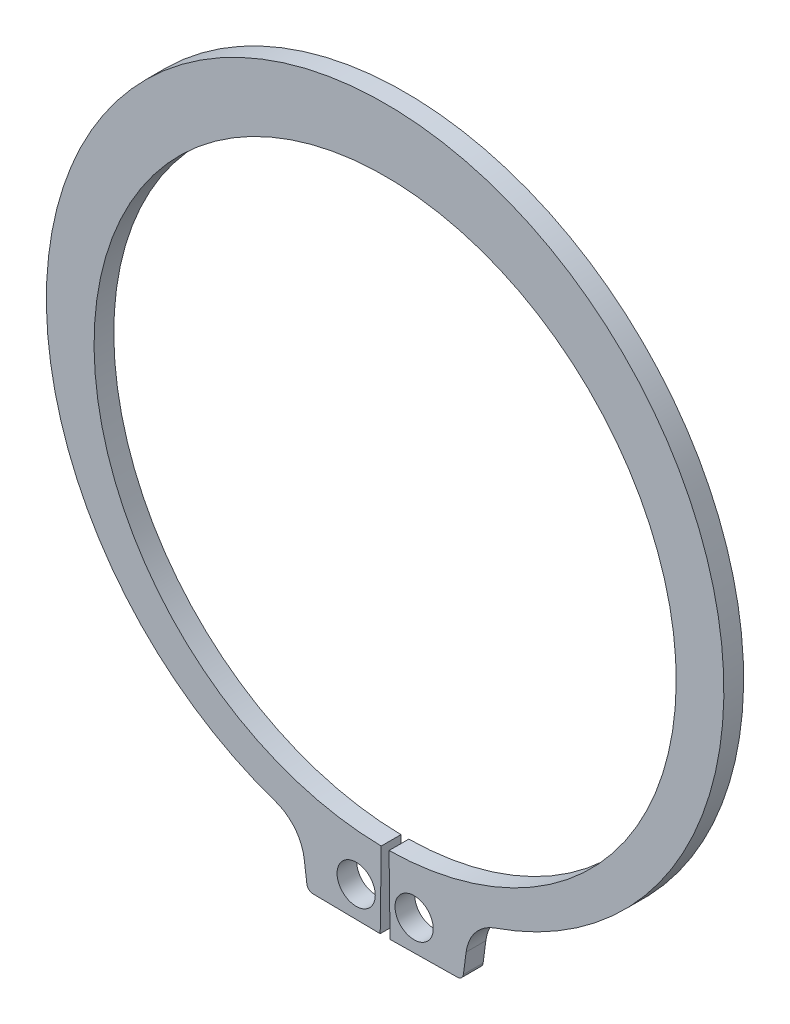
ISO-10303-21;
HEADER;
FILE_DESCRIPTION(('STEP AP214'),'2;1');
FILE_NAME('part.step','',(''),(''),'','','');
FILE_SCHEMA(('AUTOMOTIVE_DESIGN { 1 0 10303 214 1 1 1 1 }'));
ENDSEC;
DATA;
#1=APPLICATION_CONTEXT('core data for automotive mechanical design processes');
#2=APPLICATION_PROTOCOL_DEFINITION('international standard','automotive_design',2000,#1);
#3=PRODUCT_CONTEXT('',#1,'mechanical');
#4=PRODUCT('Part','Part','',(#3));
#5=PRODUCT_RELATED_PRODUCT_CATEGORY('part','',(#4));
#6=PRODUCT_DEFINITION_FORMATION('','',#4);
#7=PRODUCT_DEFINITION_CONTEXT('part definition',#1,'design');
#8=PRODUCT_DEFINITION('design','',#6,#7);
#9=PRODUCT_DEFINITION_SHAPE('','',#8);
#10=(LENGTH_UNIT() NAMED_UNIT(*) SI_UNIT(.MILLI.,.METRE.));
#11=(NAMED_UNIT(*) PLANE_ANGLE_UNIT() SI_UNIT($,.RADIAN.));
#12=(NAMED_UNIT(*) SI_UNIT($,.STERADIAN.) SOLID_ANGLE_UNIT());
#13=UNCERTAINTY_MEASURE_WITH_UNIT(LENGTH_MEASURE(1.E-05),#10,'distance_accuracy_value','');
#14=(GEOMETRIC_REPRESENTATION_CONTEXT(3) GLOBAL_UNCERTAINTY_ASSIGNED_CONTEXT((#13)) GLOBAL_UNIT_ASSIGNED_CONTEXT((#10,
#11,#12)) REPRESENTATION_CONTEXT('',''));
#15=CARTESIAN_POINT('',(0.,0.,0.));
#16=DIRECTION('',(0.,0.,1.));
#17=DIRECTION('',(1.,0.,0.));
#18=AXIS2_PLACEMENT_3D('',#15,#16,#17);
#19=CARTESIAN_POINT('',(0.,0.,-1.6));
#20=DIRECTION('',(0.,0.,1.));
#21=DIRECTION('',(1.,0.,0.));
#22=AXIS2_PLACEMENT_3D('',#19,#20,#21);
#23=CYLINDRICAL_SURFACE('',#22,23.6);
#24=CARTESIAN_POINT('',(0.,0.,0.));
#25=DIRECTION('',(0.,0.,-1.));
#26=DIRECTION('',(1.,0.,0.));
#27=AXIS2_PLACEMENT_3D('',#24,#25,#26);
#28=CIRCLE('',#27,23.6);
#29=CARTESIAN_POINT('',(-0.316778523489933,-23.5978738738696,0.));
#30=VERTEX_POINT('',#29);
#31=CARTESIAN_POINT('',(0.316778523489933,-23.5978738738696,0.));
#32=VERTEX_POINT('',#31);
#33=EDGE_CURVE('E155',#30,#32,#28,.T.);
#34=ORIENTED_EDGE('',*,*,#33,.F.);
#35=DIRECTION('',(0.,0.,1.));
#36=VECTOR('',#35,1.);
#37=CARTESIAN_POINT('',(-0.316778523489933,-23.5978738738696,-1.6));
#38=LINE('',#37,#36);
#39=CARTESIAN_POINT('',(-0.316778523489933,-23.5978738738696,-1.6));
#40=VERTEX_POINT('',#39);
#41=EDGE_CURVE('E11',#40,#30,#38,.T.);
#42=ORIENTED_EDGE('',*,*,#41,.F.);
#43=CARTESIAN_POINT('',(0.,0.,-1.6));
#44=DIRECTION('',(0.,0.,-1.));
#45=DIRECTION('',(1.,0.,0.));
#46=AXIS2_PLACEMENT_3D('',#43,#44,#45);
#47=CIRCLE('',#46,23.6);
#48=CARTESIAN_POINT('',(0.316778523489933,-23.5978738738696,-1.6));
#49=VERTEX_POINT('',#48);
#50=EDGE_CURVE('E188',#40,#49,#47,.T.);
#51=ORIENTED_EDGE('',*,*,#50,.T.);
#52=DIRECTION('',(0.,0.,1.));
#53=VECTOR('',#52,1.);
#54=CARTESIAN_POINT('',(0.316778523489933,-23.5978738738696,-1.6));
#55=LINE('',#54,#53);
#56=EDGE_CURVE('E37',#49,#32,#55,.T.);
#57=ORIENTED_EDGE('',*,*,#56,.T.);
#58=EDGE_LOOP('',(#34,#42,#51,#57));
#59=FACE_BOUND('',#58,.T.);
#60=ADVANCED_FACE('F34',(#59),#23,.F.);
#61=CARTESIAN_POINT('',(-0.316778523489933,-23.5978738738696,-1.6));
#62=DIRECTION('',(0.999909909909727,-0.0134228187919463,0.));
#63=DIRECTION('',(0.0134228187919463,0.999909909909727,0.));
#64=AXIS2_PLACEMENT_3D('',#61,#62,#63);
#65=PLANE('',#64);
#66=DIRECTION('',(0.0134228187919463,0.999909909909727,0.));
#67=VECTOR('',#66,1.);
#68=CARTESIAN_POINT('',(-0.316778523489933,-23.5978738738696,0.));
#69=LINE('',#68,#67);
#70=CARTESIAN_POINT('',(-0.4,-29.7973153153099,0.));
#71=VERTEX_POINT('',#70);
#72=EDGE_CURVE('E186',#71,#30,#69,.T.);
#73=ORIENTED_EDGE('',*,*,#72,.F.);
#74=DIRECTION('',(0.,0.,1.));
#75=VECTOR('',#74,1.);
#76=CARTESIAN_POINT('',(-0.4,-29.7973153153099,-1.6));
#77=LINE('',#76,#75);
#78=CARTESIAN_POINT('',(-0.4,-29.7973153153099,-1.6));
#79=VERTEX_POINT('',#78);
#80=EDGE_CURVE('E43',#79,#71,#77,.T.);
#81=ORIENTED_EDGE('',*,*,#80,.F.);
#82=DIRECTION('',(0.0134228187919463,0.999909909909727,0.));
#83=VECTOR('',#82,1.);
#84=CARTESIAN_POINT('',(-0.316778523489933,-23.5978738738696,-1.6));
#85=LINE('',#84,#83);
#86=EDGE_CURVE('E145',#79,#40,#85,.T.);
#87=ORIENTED_EDGE('',*,*,#86,.T.);
#88=ORIENTED_EDGE('',*,*,#41,.T.);
#89=EDGE_LOOP('',(#73,#81,#87,#88));
#90=FACE_BOUND('',#89,.T.);
#91=ADVANCED_FACE('F208',(#90),#65,.T.);
#92=CARTESIAN_POINT('',(-0.4,-29.7973153153099,-1.6));
#93=DIRECTION('',(-0.0134228187919461,-0.999909909909727,0.));
#94=DIRECTION('',(0.999909909909727,-0.0134228187919461,0.));
#95=AXIS2_PLACEMENT_3D('',#92,#93,#94);
#96=PLANE('',#95);
#97=DIRECTION('',(0.999909909909727,-0.0134228187919461,0.));
#98=VECTOR('',#97,1.);
#99=CARTESIAN_POINT('',(-0.4,-29.7973153153099,0.));
#100=LINE('',#99,#98);
#101=CARTESIAN_POINT('',(-5.85503272396845,-29.7240868023886,0.));
#102=VERTEX_POINT('',#101);
#103=EDGE_CURVE('E132',#102,#71,#100,.T.);
#104=ORIENTED_EDGE('',*,*,#103,.F.);
#105=DIRECTION('',(0.,0.,1.));
#106=VECTOR('',#105,1.);
#107=CARTESIAN_POINT('',(-5.85503272396845,-29.7240868023886,-1.6));
#108=LINE('',#107,#106);
#109=CARTESIAN_POINT('',(-5.85503272396845,-29.7240868023886,-1.6));
#110=VERTEX_POINT('',#109);
#111=EDGE_CURVE('E127',#110,#102,#108,.T.);
#112=ORIENTED_EDGE('',*,*,#111,.F.);
#113=DIRECTION('',(0.999909909909727,-0.0134228187919461,0.));
#114=VECTOR('',#113,1.);
#115=CARTESIAN_POINT('',(-0.4,-29.7973153153099,-1.6));
#116=LINE('',#115,#114);
#117=EDGE_CURVE('E130',#110,#79,#116,.T.);
#118=ORIENTED_EDGE('',*,*,#117,.T.);
#119=ORIENTED_EDGE('',*,*,#80,.T.);
#120=EDGE_LOOP('',(#104,#112,#118,#119));
#121=FACE_BOUND('',#120,.T.);
#122=ADVANCED_FACE('F129',(#121),#96,.T.);
#123=CARTESIAN_POINT('',(-5.84832131457247,-29.2241318474337,-1.6));
#124=DIRECTION('',(0.,0.,1.));
#125=DIRECTION('',(1.,0.,0.));
#126=AXIS2_PLACEMENT_3D('',#123,#124,#125);
#127=CYLINDRICAL_SURFACE('',#126,0.499999999999997);
#128=CARTESIAN_POINT('',(-5.84832131457247,-29.2241318474337,0.));
#129=DIRECTION('',(0.,0.,1.));
#130=DIRECTION('',(1.,0.,0.));
#131=AXIS2_PLACEMENT_3D('',#128,#129,#130);
#132=CIRCLE('',#131,0.499999999999997);
#133=CARTESIAN_POINT('',(-6.34404374525938,-29.2893949435437,0.));
#134=VERTEX_POINT('',#133);
#135=EDGE_CURVE('E183',#134,#102,#132,.T.);
#136=ORIENTED_EDGE('',*,*,#135,.F.);
#137=DIRECTION('',(0.,0.,1.));
#138=VECTOR('',#137,1.);
#139=CARTESIAN_POINT('',(-6.34404374525938,-29.2893949435437,-1.6));
#140=LINE('',#139,#138);
#141=CARTESIAN_POINT('',(-6.34404374525938,-29.2893949435437,-1.6));
#142=VERTEX_POINT('',#141);
#143=EDGE_CURVE('E137',#142,#134,#140,.T.);
#144=ORIENTED_EDGE('',*,*,#143,.F.);
#145=CARTESIAN_POINT('',(-5.84832131457247,-29.2241318474337,-1.6));
#146=DIRECTION('',(0.,0.,1.));
#147=DIRECTION('',(1.,0.,0.));
#148=AXIS2_PLACEMENT_3D('',#145,#146,#147);
#149=CIRCLE('',#148,0.499999999999997);
#150=EDGE_CURVE('E143',#142,#110,#149,.T.);
#151=ORIENTED_EDGE('',*,*,#150,.T.);
#152=ORIENTED_EDGE('',*,*,#111,.T.);
#153=EDGE_LOOP('',(#136,#144,#151,#152));
#154=FACE_BOUND('',#153,.T.);
#155=ADVANCED_FACE('F147',(#154),#127,.T.);
#156=CARTESIAN_POINT('',(-6.56613254039972,-27.6024630644663,-1.6));
#157=DIRECTION('',(-0.99144486137381,-0.130526192220053,0.));
#158=DIRECTION('',(0.130526192220053,-0.99144486137381,0.));
#159=AXIS2_PLACEMENT_3D('',#156,#157,#158);
#160=PLANE('',#159);
#161=DIRECTION('',(0.130526192220053,-0.99144486137381,0.));
#162=VECTOR('',#161,1.);
#163=CARTESIAN_POINT('',(-6.56613254039972,-27.6024630644663,0.));
#164=LINE('',#163,#162);
#165=CARTESIAN_POINT('',(-6.56613254039972,-27.6024630644663,0.));
#166=VERTEX_POINT('',#165);
#167=EDGE_CURVE('E180',#166,#134,#164,.T.);
#168=ORIENTED_EDGE('',*,*,#167,.F.);
#169=DIRECTION('',(0.,0.,1.));
#170=VECTOR('',#169,1.);
#171=CARTESIAN_POINT('',(-6.56613254039972,-27.6024630644663,-1.6));
#172=LINE('',#171,#170);
#173=CARTESIAN_POINT('',(-6.56613254039972,-27.6024630644663,-1.6));
#174=VERTEX_POINT('',#173);
#175=EDGE_CURVE('E192',#174,#166,#172,.T.);
#176=ORIENTED_EDGE('',*,*,#175,.F.);
#177=DIRECTION('',(0.130526192220053,-0.99144486137381,0.));
#178=VECTOR('',#177,1.);
#179=CARTESIAN_POINT('',(-6.56613254039972,-27.6024630644663,-1.6));
#180=LINE('',#179,#178);
#181=EDGE_CURVE('E148',#174,#142,#180,.T.);
#182=ORIENTED_EDGE('',*,*,#181,.T.);
#183=ORIENTED_EDGE('',*,*,#143,.T.);
#184=EDGE_LOOP('',(#168,#176,#182,#183));
#185=FACE_BOUND('',#184,.T.);
#186=ADVANCED_FACE('F221',(#185),#160,.T.);
#187=CARTESIAN_POINT('',(-10.0358369309074,-28.0592583133666,-1.6));
#188=DIRECTION('',(0.,0.,1.));
#189=DIRECTION('',(1.,0.,0.));
#190=AXIS2_PLACEMENT_3D('',#187,#188,#189);
#191=CYLINDRICAL_SURFACE('',#190,3.49964433291821);
#192=CARTESIAN_POINT('',(-10.0358369309074,-28.0592583133666,0.));
#193=DIRECTION('',(0.,0.,-1.));
#194=DIRECTION('',(1.,0.,0.));
#195=AXIS2_PLACEMENT_3D('',#192,#193,#194);
#196=CIRCLE('',#195,3.49964433291821);
#197=CARTESIAN_POINT('',(-8.90159904827217,-24.7485159672271,0.));
#198=VERTEX_POINT('',#197);
#199=EDGE_CURVE('E177',#198,#166,#196,.T.);
#200=ORIENTED_EDGE('',*,*,#199,.F.);
#201=DIRECTION('',(0.,0.,1.));
#202=VECTOR('',#201,1.);
#203=CARTESIAN_POINT('',(-8.90159904827217,-24.7485159672271,-1.6));
#204=LINE('',#203,#202);
#205=CARTESIAN_POINT('',(-8.90159904827217,-24.7485159672271,-1.6));
#206=VERTEX_POINT('',#205);
#207=EDGE_CURVE('E194',#206,#198,#204,.T.);
#208=ORIENTED_EDGE('',*,*,#207,.F.);
#209=CARTESIAN_POINT('',(-10.0358369309074,-28.0592583133666,-1.6));
#210=DIRECTION('',(0.,0.,-1.));
#211=DIRECTION('',(1.,0.,0.));
#212=AXIS2_PLACEMENT_3D('',#209,#210,#211);
#213=CIRCLE('',#212,3.49964433291821);
#214=EDGE_CURVE('E150',#206,#174,#213,.T.);
#215=ORIENTED_EDGE('',*,*,#214,.T.);
#216=ORIENTED_EDGE('',*,*,#175,.T.);
#217=EDGE_LOOP('',(#200,#208,#215,#216));
#218=FACE_BOUND('',#217,.T.);
#219=ADVANCED_FACE('F224',(#218),#191,.F.);
#220=CARTESIAN_POINT('',(0.,1.23448228089832,-1.6));
#221=DIRECTION('',(0.,0.,1.));
#222=DIRECTION('',(1.,0.,0.));
#223=AXIS2_PLACEMENT_3D('',#220,#221,#222);
#224=CYLINDRICAL_SURFACE('',#223,27.4655177191017);
#225=CARTESIAN_POINT('',(0.,1.23448228089832,0.));
#226=DIRECTION('',(0.,0.,1.));
#227=DIRECTION('',(1.,0.,0.));
#228=AXIS2_PLACEMENT_3D('',#225,#226,#227);
#229=CIRCLE('',#228,27.4655177191017);
#230=CARTESIAN_POINT('',(8.90159904827217,-24.7485159672271,0.));
#231=VERTEX_POINT('',#230);
#232=EDGE_CURVE('E174',#231,#198,#229,.T.);
#233=ORIENTED_EDGE('',*,*,#232,.F.);
#234=DIRECTION('',(0.,0.,1.));
#235=VECTOR('',#234,1.);
#236=CARTESIAN_POINT('',(8.90159904827217,-24.7485159672271,-1.6));
#237=LINE('',#236,#235);
#238=CARTESIAN_POINT('',(8.90159904827217,-24.7485159672271,-1.6));
#239=VERTEX_POINT('',#238);
#240=EDGE_CURVE('E196',#239,#231,#237,.T.);
#241=ORIENTED_EDGE('',*,*,#240,.F.);
#242=CARTESIAN_POINT('',(0.,1.23448228089832,-1.6));
#243=DIRECTION('',(0.,0.,1.));
#244=DIRECTION('',(1.,0.,0.));
#245=AXIS2_PLACEMENT_3D('',#242,#243,#244);
#246=CIRCLE('',#245,27.4655177191017);
#247=EDGE_CURVE('E298',#239,#206,#246,.T.);
#248=ORIENTED_EDGE('',*,*,#247,.T.);
#249=ORIENTED_EDGE('',*,*,#207,.T.);
#250=EDGE_LOOP('',(#233,#241,#248,#249));
#251=FACE_BOUND('',#250,.T.);
#252=ADVANCED_FACE('F228',(#251),#224,.T.);
#253=CARTESIAN_POINT('',(10.0358369309074,-28.0592583133666,-1.6));
#254=DIRECTION('',(0.,0.,1.));
#255=DIRECTION('',(1.,0.,0.));
#256=AXIS2_PLACEMENT_3D('',#253,#254,#255);
#257=CYLINDRICAL_SURFACE('',#256,3.49964433291821);
#258=CARTESIAN_POINT('',(10.0358369309074,-28.0592583133666,0.));
#259=DIRECTION('',(0.,0.,-1.));
#260=DIRECTION('',(1.,0.,0.));
#261=AXIS2_PLACEMENT_3D('',#258,#259,#260);
#262=CIRCLE('',#261,3.49964433291821);
#263=CARTESIAN_POINT('',(6.56613254039971,-27.6024630644663,0.));
#264=VERTEX_POINT('',#263);
#265=EDGE_CURVE('E171',#264,#231,#262,.T.);
#266=ORIENTED_EDGE('',*,*,#265,.F.);
#267=DIRECTION('',(0.,0.,1.));
#268=VECTOR('',#267,1.);
#269=CARTESIAN_POINT('',(6.56613254039971,-27.6024630644663,-1.6));
#270=LINE('',#269,#268);
#271=CARTESIAN_POINT('',(6.56613254039971,-27.6024630644663,-1.6));
#272=VERTEX_POINT('',#271);
#273=EDGE_CURVE('E198',#272,#264,#270,.T.);
#274=ORIENTED_EDGE('',*,*,#273,.F.);
#275=CARTESIAN_POINT('',(10.0358369309074,-28.0592583133666,-1.6));
#276=DIRECTION('',(0.,0.,-1.));
#277=DIRECTION('',(1.,0.,0.));
#278=AXIS2_PLACEMENT_3D('',#275,#276,#277);
#279=CIRCLE('',#278,3.49964433291821);
#280=EDGE_CURVE('E295',#272,#239,#279,.T.);
#281=ORIENTED_EDGE('',*,*,#280,.T.);
#282=ORIENTED_EDGE('',*,*,#240,.T.);
#283=EDGE_LOOP('',(#266,#274,#281,#282));
#284=FACE_BOUND('',#283,.T.);
#285=ADVANCED_FACE('F232',(#284),#257,.F.);
#286=CARTESIAN_POINT('',(6.56613254039971,-27.6024630644663,-1.6));
#287=DIRECTION('',(0.991444861373811,-0.13052619222005,0.));
#288=DIRECTION('',(0.13052619222005,0.991444861373811,0.));
#289=AXIS2_PLACEMENT_3D('',#286,#287,#288);
#290=PLANE('',#289);
#291=DIRECTION('',(0.13052619222005,0.991444861373811,0.));
#292=VECTOR('',#291,1.);
#293=CARTESIAN_POINT('',(6.56613254039971,-27.6024630644663,0.));
#294=LINE('',#293,#292);
#295=CARTESIAN_POINT('',(6.34404374525938,-29.2893949435437,0.));
#296=VERTEX_POINT('',#295);
#297=EDGE_CURVE('E168',#296,#264,#294,.T.);
#298=ORIENTED_EDGE('',*,*,#297,.F.);
#299=DIRECTION('',(0.,0.,1.));
#300=VECTOR('',#299,1.);
#301=CARTESIAN_POINT('',(6.34404374525938,-29.2893949435437,-1.6));
#302=LINE('',#301,#300);
#303=CARTESIAN_POINT('',(6.34404374525938,-29.2893949435437,-1.6));
#304=VERTEX_POINT('',#303);
#305=EDGE_CURVE('E200',#304,#296,#302,.T.);
#306=ORIENTED_EDGE('',*,*,#305,.F.);
#307=DIRECTION('',(0.13052619222005,0.991444861373811,0.));
#308=VECTOR('',#307,1.);
#309=CARTESIAN_POINT('',(6.56613254039971,-27.6024630644663,-1.6));
#310=LINE('',#309,#308);
#311=EDGE_CURVE('E292',#304,#272,#310,.T.);
#312=ORIENTED_EDGE('',*,*,#311,.T.);
#313=ORIENTED_EDGE('',*,*,#273,.T.);
#314=EDGE_LOOP('',(#298,#306,#312,#313));
#315=FACE_BOUND('',#314,.T.);
#316=ADVANCED_FACE('F236',(#315),#290,.T.);
#317=CARTESIAN_POINT('',(5.84832131457247,-29.2241318474337,-1.6));
#318=DIRECTION('',(0.,0.,1.));
#319=DIRECTION('',(1.,0.,0.));
#320=AXIS2_PLACEMENT_3D('',#317,#318,#319);
#321=CYLINDRICAL_SURFACE('',#320,0.499999999999997);
#322=CARTESIAN_POINT('',(5.84832131457247,-29.2241318474337,0.));
#323=DIRECTION('',(0.,0.,1.));
#324=DIRECTION('',(-1.,0.,0.));
#325=AXIS2_PLACEMENT_3D('',#322,#323,#324);
#326=CIRCLE('',#325,0.499999999999997);
#327=CARTESIAN_POINT('',(5.85503272396845,-29.7240868023886,0.));
#328=VERTEX_POINT('',#327);
#329=EDGE_CURVE('E165',#328,#296,#326,.T.);
#330=ORIENTED_EDGE('',*,*,#329,.F.);
#331=DIRECTION('',(0.,0.,1.));
#332=VECTOR('',#331,1.);
#333=CARTESIAN_POINT('',(5.85503272396845,-29.7240868023886,-1.6));
#334=LINE('',#333,#332);
#335=CARTESIAN_POINT('',(5.85503272396845,-29.7240868023886,-1.6));
#336=VERTEX_POINT('',#335);
#337=EDGE_CURVE('E202',#336,#328,#334,.T.);
#338=ORIENTED_EDGE('',*,*,#337,.F.);
#339=CARTESIAN_POINT('',(5.84832131457247,-29.2241318474337,-1.6));
#340=DIRECTION('',(0.,0.,1.));
#341=DIRECTION('',(-1.,0.,0.));
#342=AXIS2_PLACEMENT_3D('',#339,#340,#341);
#343=CIRCLE('',#342,0.499999999999997);
#344=EDGE_CURVE('E289',#336,#304,#343,.T.);
#345=ORIENTED_EDGE('',*,*,#344,.T.);
#346=ORIENTED_EDGE('',*,*,#305,.T.);
#347=EDGE_LOOP('',(#330,#338,#345,#346));
#348=FACE_BOUND('',#347,.T.);
#349=ADVANCED_FACE('F240',(#348),#321,.T.);
#350=CARTESIAN_POINT('',(0.4,-29.7973153153099,-1.6));
#351=DIRECTION('',(0.0134228187919461,-0.999909909909727,0.));
#352=DIRECTION('',(0.999909909909727,0.0134228187919461,0.));
#353=AXIS2_PLACEMENT_3D('',#350,#351,#352);
#354=PLANE('',#353);
#355=DIRECTION('',(0.999909909909727,0.0134228187919461,0.));
#356=VECTOR('',#355,1.);
#357=CARTESIAN_POINT('',(0.4,-29.7973153153099,0.));
#358=LINE('',#357,#356);
#359=CARTESIAN_POINT('',(0.4,-29.7973153153099,0.));
#360=VERTEX_POINT('',#359);
#361=EDGE_CURVE('E162',#360,#328,#358,.T.);
#362=ORIENTED_EDGE('',*,*,#361,.F.);
#363=DIRECTION('',(0.,0.,1.));
#364=VECTOR('',#363,1.);
#365=CARTESIAN_POINT('',(0.4,-29.7973153153099,-1.6));
#366=LINE('',#365,#364);
#367=CARTESIAN_POINT('',(0.4,-29.7973153153099,-1.6));
#368=VERTEX_POINT('',#367);
#369=EDGE_CURVE('E203',#368,#360,#366,.T.);
#370=ORIENTED_EDGE('',*,*,#369,.F.);
#371=DIRECTION('',(0.999909909909727,0.0134228187919461,0.));
#372=VECTOR('',#371,1.);
#373=CARTESIAN_POINT('',(0.4,-29.7973153153099,-1.6));
#374=LINE('',#373,#372);
#375=EDGE_CURVE('E286',#368,#336,#374,.T.);
#376=ORIENTED_EDGE('',*,*,#375,.T.);
#377=ORIENTED_EDGE('',*,*,#337,.T.);
#378=EDGE_LOOP('',(#362,#370,#376,#377));
#379=FACE_BOUND('',#378,.T.);
#380=ADVANCED_FACE('F244',(#379),#354,.T.);
#381=CARTESIAN_POINT('',(0.316778523489933,-23.5978738738696,-1.6));
#382=DIRECTION('',(-0.999909909909727,-0.0134228187919463,0.));
#383=DIRECTION('',(0.0134228187919463,-0.999909909909727,0.));
#384=AXIS2_PLACEMENT_3D('',#381,#382,#383);
#385=PLANE('',#384);
#386=DIRECTION('',(0.0134228187919463,-0.999909909909727,0.));
#387=VECTOR('',#386,1.);
#388=CARTESIAN_POINT('',(0.316778523489933,-23.5978738738696,0.));
#389=LINE('',#388,#387);
#390=EDGE_CURVE('E158',#32,#360,#389,.T.);
#391=ORIENTED_EDGE('',*,*,#390,.F.);
#392=ORIENTED_EDGE('',*,*,#56,.F.);
#393=DIRECTION('',(0.0134228187919463,-0.999909909909727,0.));
#394=VECTOR('',#393,1.);
#395=CARTESIAN_POINT('',(0.316778523489933,-23.5978738738696,-1.6));
#396=LINE('',#395,#394);
#397=EDGE_CURVE('E284',#49,#368,#396,.T.);
#398=ORIENTED_EDGE('',*,*,#397,.T.);
#399=ORIENTED_EDGE('',*,*,#369,.T.);
#400=EDGE_LOOP('',(#391,#392,#398,#399));
#401=FACE_BOUND('',#400,.T.);
#402=ADVANCED_FACE('F205',(#401),#385,.T.);
#403=CARTESIAN_POINT('',(0.,0.,-1.6));
#404=DIRECTION('',(0.,0.,1.));
#405=DIRECTION('',(1.,0.,0.));
#406=AXIS2_PLACEMENT_3D('',#403,#404,#405);
#407=PLANE('',#406);
#408=CARTESIAN_POINT('',(-2.35,-27.2990384446046,-1.6));
#409=DIRECTION('',(0.,0.,1.));
#410=DIRECTION('',(1.,0.,0.));
#411=AXIS2_PLACEMENT_3D('',#408,#409,#410);
#412=CIRCLE('',#411,1.55);
#413=CARTESIAN_POINT('',(-0.8,-27.2990384446046,-1.6));
#414=VERTEX_POINT('',#413);
#415=EDGE_CURVE('E271',#414,#414,#412,.T.);
#416=ORIENTED_EDGE('',*,*,#415,.T.);
#417=EDGE_LOOP('',(#416));
#418=FACE_BOUND('',#417,.T.);
#419=CARTESIAN_POINT('',(2.35,-27.2990384446046,-1.6));
#420=DIRECTION('',(0.,0.,1.));
#421=DIRECTION('',(1.,0.,0.));
#422=AXIS2_PLACEMENT_3D('',#419,#420,#421);
#423=CIRCLE('',#422,1.55);
#424=CARTESIAN_POINT('',(3.9,-27.2990384446046,-1.6));
#425=VERTEX_POINT('',#424);
#426=EDGE_CURVE('E159',#425,#425,#423,.T.);
#427=ORIENTED_EDGE('',*,*,#426,.T.);
#428=EDGE_LOOP('',(#427));
#429=FACE_BOUND('',#428,.T.);
#430=ORIENTED_EDGE('',*,*,#50,.F.);
#431=ORIENTED_EDGE('',*,*,#86,.F.);
#432=ORIENTED_EDGE('',*,*,#117,.F.);
#433=ORIENTED_EDGE('',*,*,#150,.F.);
#434=ORIENTED_EDGE('',*,*,#181,.F.);
#435=ORIENTED_EDGE('',*,*,#214,.F.);
#436=ORIENTED_EDGE('',*,*,#247,.F.);
#437=ORIENTED_EDGE('',*,*,#280,.F.);
#438=ORIENTED_EDGE('',*,*,#311,.F.);
#439=ORIENTED_EDGE('',*,*,#344,.F.);
#440=ORIENTED_EDGE('',*,*,#375,.F.);
#441=ORIENTED_EDGE('',*,*,#397,.F.);
#442=EDGE_LOOP('',(#430,#431,#432,#433,#434,#435,#436,#437,#438,#439,#440,#441));
#443=FACE_BOUND('',#442,.T.);
#444=ADVANCED_FACE('F141',(#418,#429,#443),#407,.F.);
#445=CARTESIAN_POINT('',(0.,0.,0.));
#446=DIRECTION('',(0.,0.,1.));
#447=DIRECTION('',(1.,0.,0.));
#448=AXIS2_PLACEMENT_3D('',#445,#446,#447);
#449=PLANE('',#448);
#450=CARTESIAN_POINT('',(-2.35,-27.2990384446046,0.));
#451=DIRECTION('',(0.,0.,1.));
#452=DIRECTION('',(1.,0.,0.));
#453=AXIS2_PLACEMENT_3D('',#450,#451,#452);
#454=CIRCLE('',#453,1.55);
#455=CARTESIAN_POINT('',(-0.8,-27.2990384446046,0.));
#456=VERTEX_POINT('',#455);
#457=EDGE_CURVE('E274',#456,#456,#454,.T.);
#458=ORIENTED_EDGE('',*,*,#457,.F.);
#459=EDGE_LOOP('',(#458));
#460=FACE_BOUND('',#459,.T.);
#461=CARTESIAN_POINT('',(2.35,-27.2990384446046,0.));
#462=DIRECTION('',(0.,0.,1.));
#463=DIRECTION('',(1.,0.,0.));
#464=AXIS2_PLACEMENT_3D('',#461,#462,#463);
#465=CIRCLE('',#464,1.55);
#466=CARTESIAN_POINT('',(3.9,-27.2990384446046,0.));
#467=VERTEX_POINT('',#466);
#468=EDGE_CURVE('E276',#467,#467,#465,.T.);
#469=ORIENTED_EDGE('',*,*,#468,.F.);
#470=EDGE_LOOP('',(#469));
#471=FACE_BOUND('',#470,.T.);
#472=ORIENTED_EDGE('',*,*,#33,.T.);
#473=ORIENTED_EDGE('',*,*,#390,.T.);
#474=ORIENTED_EDGE('',*,*,#361,.T.);
#475=ORIENTED_EDGE('',*,*,#329,.T.);
#476=ORIENTED_EDGE('',*,*,#297,.T.);
#477=ORIENTED_EDGE('',*,*,#265,.T.);
#478=ORIENTED_EDGE('',*,*,#232,.T.);
#479=ORIENTED_EDGE('',*,*,#199,.T.);
#480=ORIENTED_EDGE('',*,*,#167,.T.);
#481=ORIENTED_EDGE('',*,*,#135,.T.);
#482=ORIENTED_EDGE('',*,*,#103,.T.);
#483=ORIENTED_EDGE('',*,*,#72,.T.);
#484=EDGE_LOOP('',(#472,#473,#474,#475,#476,#477,#478,#479,#480,#481,#482,#483));
#485=FACE_BOUND('',#484,.T.);
#486=ADVANCED_FACE('F207',(#460,#471,#485),#449,.T.);
#487=CARTESIAN_POINT('',(2.35,-27.2990384446046,-1.6));
#488=DIRECTION('',(0.,0.,1.));
#489=DIRECTION('',(1.,0.,0.));
#490=AXIS2_PLACEMENT_3D('',#487,#488,#489);
#491=CYLINDRICAL_SURFACE('',#490,1.55);
#492=ORIENTED_EDGE('',*,*,#426,.F.);
#493=EDGE_LOOP('',(#492));
#494=FACE_BOUND('',#493,.T.);
#495=ORIENTED_EDGE('',*,*,#468,.T.);
#496=EDGE_LOOP('',(#495));
#497=FACE_BOUND('',#496,.T.);
#498=ADVANCED_FACE('F256',(#494,#497),#491,.F.);
#499=CARTESIAN_POINT('',(-2.35,-27.2990384446046,-1.6));
#500=DIRECTION('',(0.,0.,1.));
#501=DIRECTION('',(1.,0.,0.));
#502=AXIS2_PLACEMENT_3D('',#499,#500,#501);
#503=CYLINDRICAL_SURFACE('',#502,1.55);
#504=ORIENTED_EDGE('',*,*,#415,.F.);
#505=EDGE_LOOP('',(#504));
#506=FACE_BOUND('',#505,.T.);
#507=ORIENTED_EDGE('',*,*,#457,.T.);
#508=EDGE_LOOP('',(#507));
#509=FACE_BOUND('',#508,.T.);
#510=ADVANCED_FACE('F263',(#506,#509),#503,.F.);
#511=CLOSED_SHELL('',(#60,#91,#122,#155,#186,#219,#252,#285,#316,#349,#380,#402,#444,#486,#498,#510));
#512=MANIFOLD_SOLID_BREP('B2',#511);
#513=ADVANCED_BREP_SHAPE_REPRESENTATION('',(#18,#512),#14);
#514=SHAPE_DEFINITION_REPRESENTATION(#9,#513);
ENDSEC;
END-ISO-10303-21;
